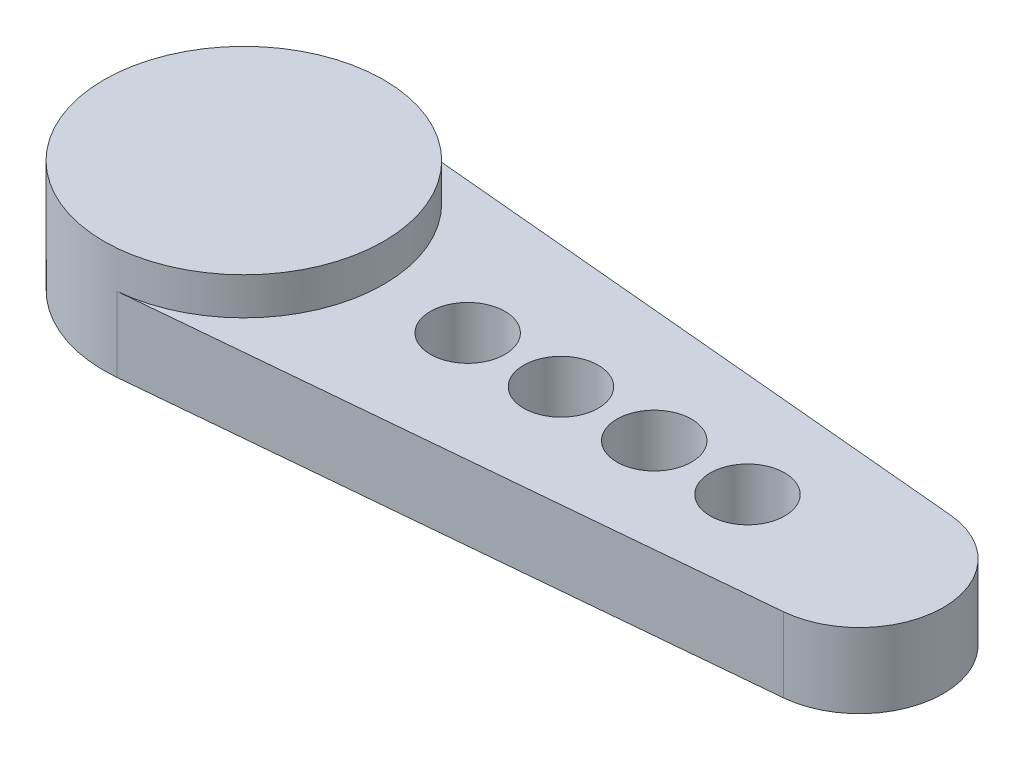
ISO-10303-21;
HEADER;
FILE_DESCRIPTION(('STEP AP214'),'2;1');
FILE_NAME('part.step','',(''),(''),'','','');
FILE_SCHEMA(('AUTOMOTIVE_DESIGN { 1 0 10303 214 1 1 1 1 }'));
ENDSEC;
DATA;
#1=APPLICATION_CONTEXT('core data for automotive mechanical design processes');
#2=APPLICATION_PROTOCOL_DEFINITION('international standard','automotive_design',2000,#1);
#3=PRODUCT_CONTEXT('',#1,'mechanical');
#4=PRODUCT('Part','Part','',(#3));
#5=PRODUCT_RELATED_PRODUCT_CATEGORY('part','',(#4));
#6=PRODUCT_DEFINITION_FORMATION('','',#4);
#7=PRODUCT_DEFINITION_CONTEXT('part definition',#1,'design');
#8=PRODUCT_DEFINITION('design','',#6,#7);
#9=PRODUCT_DEFINITION_SHAPE('','',#8);
#10=(LENGTH_UNIT() NAMED_UNIT(*) SI_UNIT(.MILLI.,.METRE.));
#11=(NAMED_UNIT(*) PLANE_ANGLE_UNIT() SI_UNIT($,.RADIAN.));
#12=(NAMED_UNIT(*) SI_UNIT($,.STERADIAN.) SOLID_ANGLE_UNIT());
#13=UNCERTAINTY_MEASURE_WITH_UNIT(LENGTH_MEASURE(1.E-05),#10,'distance_accuracy_value','');
#14=(GEOMETRIC_REPRESENTATION_CONTEXT(3) GLOBAL_UNCERTAINTY_ASSIGNED_CONTEXT((#13)) GLOBAL_UNIT_ASSIGNED_CONTEXT((#10,
#11,#12)) REPRESENTATION_CONTEXT('',''));
#15=CARTESIAN_POINT('',(0.,0.,0.));
#16=DIRECTION('',(0.,0.,1.));
#17=DIRECTION('',(1.,0.,0.));
#18=AXIS2_PLACEMENT_3D('',#15,#16,#17);
#19=CARTESIAN_POINT('',(0.,2.,0.));
#20=DIRECTION('',(0.,1.,0.));
#21=DIRECTION('',(0.,0.,1.));
#22=AXIS2_PLACEMENT_3D('',#19,#20,#21);
#23=PLANE('',#22);
#24=CARTESIAN_POINT('',(0.,2.,0.));
#25=DIRECTION('',(0.,1.,0.));
#26=DIRECTION('',(0.,0.,1.));
#27=AXIS2_PLACEMENT_3D('',#24,#25,#26);
#28=CIRCLE('',#27,3.75);
#29=CARTESIAN_POINT('',(0.340909090909091,2.,3.73447198298977));
#30=VERTEX_POINT('',#29);
#31=CARTESIAN_POINT('',(0.340909090909091,2.,-3.73447198298977));
#32=VERTEX_POINT('',#31);
#33=EDGE_CURVE('E88',#30,#32,#28,.T.);
#34=ORIENTED_EDGE('',*,*,#33,.F.);
#35=DIRECTION('',(0.995859195463938,0.,-0.0909090909090909));
#36=VECTOR('',#35,1.);
#37=CARTESIAN_POINT('',(0.340909090909091,2.,3.73447198298977));
#38=LINE('',#37,#36);
#39=CARTESIAN_POINT('',(16.7045454545455,2.,2.24068318979386));
#40=VERTEX_POINT('',#39);
#41=EDGE_CURVE('E80',#30,#40,#38,.T.);
#42=ORIENTED_EDGE('',*,*,#41,.T.);
#43=CARTESIAN_POINT('',(16.5,2.,0.));
#44=DIRECTION('',(0.,1.,0.));
#45=DIRECTION('',(0.,0.,1.));
#46=AXIS2_PLACEMENT_3D('',#43,#44,#45);
#47=CIRCLE('',#46,2.25);
#48=CARTESIAN_POINT('',(16.7045454545455,2.,-2.24068318979386));
#49=VERTEX_POINT('',#48);
#50=EDGE_CURVE('E94',#40,#49,#47,.T.);
#51=ORIENTED_EDGE('',*,*,#50,.T.);
#52=DIRECTION('',(-0.995859195463938,0.,-0.0909090909090909));
#53=VECTOR('',#52,1.);
#54=CARTESIAN_POINT('',(0.340909090909091,2.,-3.73447198298977));
#55=LINE('',#54,#53);
#56=EDGE_CURVE('E53',#49,#32,#55,.T.);
#57=ORIENTED_EDGE('',*,*,#56,.T.);
#58=EDGE_LOOP('',(#34,#42,#51,#57));
#59=FACE_BOUND('',#58,.T.);
#60=CARTESIAN_POINT('',(11.,2.,0.));
#61=DIRECTION('',(0.,1.,0.));
#62=DIRECTION('',(0.,0.,1.));
#63=AXIS2_PLACEMENT_3D('',#60,#61,#62);
#64=CIRCLE('',#63,1.);
#65=CARTESIAN_POINT('',(11.,2.,1.));
#66=VERTEX_POINT('',#65);
#67=EDGE_CURVE('E114',#66,#66,#64,.T.);
#68=ORIENTED_EDGE('',*,*,#67,.F.);
#69=EDGE_LOOP('',(#68));
#70=FACE_BOUND('',#69,.T.);
#71=CARTESIAN_POINT('',(6.,2.,0.));
#72=DIRECTION('',(0.,1.,0.));
#73=DIRECTION('',(0.,0.,1.));
#74=AXIS2_PLACEMENT_3D('',#71,#72,#73);
#75=CIRCLE('',#74,1.);
#76=CARTESIAN_POINT('',(6.,2.,1.));
#77=VERTEX_POINT('',#76);
#78=EDGE_CURVE('E126',#77,#77,#75,.T.);
#79=ORIENTED_EDGE('',*,*,#78,.F.);
#80=EDGE_LOOP('',(#79));
#81=FACE_BOUND('',#80,.T.);
#82=CARTESIAN_POINT('',(8.5,2.,0.));
#83=DIRECTION('',(0.,1.,0.));
#84=DIRECTION('',(0.,0.,1.));
#85=AXIS2_PLACEMENT_3D('',#82,#83,#84);
#86=CIRCLE('',#85,1.);
#87=CARTESIAN_POINT('',(8.5,2.,1.));
#88=VERTEX_POINT('',#87);
#89=EDGE_CURVE('E120',#88,#88,#86,.T.);
#90=ORIENTED_EDGE('',*,*,#89,.F.);
#91=EDGE_LOOP('',(#90));
#92=FACE_BOUND('',#91,.T.);
#93=CARTESIAN_POINT('',(13.5,2.,0.));
#94=DIRECTION('',(0.,1.,0.));
#95=DIRECTION('',(0.,0.,1.));
#96=AXIS2_PLACEMENT_3D('',#93,#94,#95);
#97=CIRCLE('',#96,1.);
#98=CARTESIAN_POINT('',(13.5,2.,1.));
#99=VERTEX_POINT('',#98);
#100=EDGE_CURVE('E108',#99,#99,#97,.T.);
#101=ORIENTED_EDGE('',*,*,#100,.F.);
#102=EDGE_LOOP('',(#101));
#103=FACE_BOUND('',#102,.T.);
#104=ADVANCED_FACE('F36',(#59,#70,#81,#92,#103),#23,.T.);
#105=CARTESIAN_POINT('',(0.,0.,0.));
#106=DIRECTION('',(0.,1.,0.));
#107=DIRECTION('',(0.,0.,1.));
#108=AXIS2_PLACEMENT_3D('',#105,#106,#107);
#109=PLANE('',#108);
#110=CARTESIAN_POINT('',(0.,0.,0.));
#111=DIRECTION('',(0.,-1.,0.));
#112=DIRECTION('',(0.,0.,-1.));
#113=AXIS2_PLACEMENT_3D('',#110,#111,#112);
#114=CIRCLE('',#113,2.75);
#115=CARTESIAN_POINT('',(0.,0.,-2.75));
#116=VERTEX_POINT('',#115);
#117=EDGE_CURVE('E104',#116,#116,#114,.T.);
#118=ORIENTED_EDGE('',*,*,#117,.F.);
#119=EDGE_LOOP('',(#118));
#120=FACE_BOUND('',#119,.T.);
#121=CARTESIAN_POINT('',(0.,0.,0.));
#122=DIRECTION('',(0.,1.,0.));
#123=DIRECTION('',(0.,0.,1.));
#124=AXIS2_PLACEMENT_3D('',#121,#122,#123);
#125=CIRCLE('',#124,3.75);
#126=CARTESIAN_POINT('',(0.340909090909091,0.,-3.73447198298977));
#127=VERTEX_POINT('',#126);
#128=CARTESIAN_POINT('',(0.340909090909091,0.,3.73447198298977));
#129=VERTEX_POINT('',#128);
#130=EDGE_CURVE('E90',#127,#129,#125,.T.);
#131=ORIENTED_EDGE('',*,*,#130,.F.);
#132=DIRECTION('',(-0.995859195463938,0.,-0.0909090909090909));
#133=VECTOR('',#132,1.);
#134=CARTESIAN_POINT('',(0.340909090909091,0.,-3.73447198298977));
#135=LINE('',#134,#133);
#136=CARTESIAN_POINT('',(16.7045454545455,0.,-2.24068318979386));
#137=VERTEX_POINT('',#136);
#138=EDGE_CURVE('E76',#137,#127,#135,.T.);
#139=ORIENTED_EDGE('',*,*,#138,.F.);
#140=CARTESIAN_POINT('',(16.5,0.,0.));
#141=DIRECTION('',(0.,1.,0.));
#142=DIRECTION('',(0.,0.,1.));
#143=AXIS2_PLACEMENT_3D('',#140,#141,#142);
#144=CIRCLE('',#143,2.25);
#145=CARTESIAN_POINT('',(16.7045454545455,0.,2.24068318979386));
#146=VERTEX_POINT('',#145);
#147=EDGE_CURVE('E71',#146,#137,#144,.T.);
#148=ORIENTED_EDGE('',*,*,#147,.F.);
#149=DIRECTION('',(0.995859195463938,0.,-0.0909090909090909));
#150=VECTOR('',#149,1.);
#151=CARTESIAN_POINT('',(0.340909090909091,0.,3.73447198298977));
#152=LINE('',#151,#150);
#153=EDGE_CURVE('E135',#129,#146,#152,.T.);
#154=ORIENTED_EDGE('',*,*,#153,.F.);
#155=EDGE_LOOP('',(#131,#139,#148,#154));
#156=FACE_BOUND('',#155,.T.);
#157=CARTESIAN_POINT('',(6.,0.,0.));
#158=DIRECTION('',(0.,1.,0.));
#159=DIRECTION('',(0.,0.,1.));
#160=AXIS2_PLACEMENT_3D('',#157,#158,#159);
#161=CIRCLE('',#160,1.);
#162=CARTESIAN_POINT('',(6.,0.,1.));
#163=VERTEX_POINT('',#162);
#164=EDGE_CURVE('E123',#163,#163,#161,.T.);
#165=ORIENTED_EDGE('',*,*,#164,.T.);
#166=EDGE_LOOP('',(#165));
#167=FACE_BOUND('',#166,.T.);
#168=CARTESIAN_POINT('',(8.5,0.,0.));
#169=DIRECTION('',(0.,1.,0.));
#170=DIRECTION('',(0.,0.,1.));
#171=AXIS2_PLACEMENT_3D('',#168,#169,#170);
#172=CIRCLE('',#171,1.);
#173=CARTESIAN_POINT('',(8.5,0.,1.));
#174=VERTEX_POINT('',#173);
#175=EDGE_CURVE('E117',#174,#174,#172,.T.);
#176=ORIENTED_EDGE('',*,*,#175,.T.);
#177=EDGE_LOOP('',(#176));
#178=FACE_BOUND('',#177,.T.);
#179=CARTESIAN_POINT('',(11.,0.,0.));
#180=DIRECTION('',(0.,1.,0.));
#181=DIRECTION('',(0.,0.,1.));
#182=AXIS2_PLACEMENT_3D('',#179,#180,#181);
#183=CIRCLE('',#182,1.);
#184=CARTESIAN_POINT('',(11.,0.,1.));
#185=VERTEX_POINT('',#184);
#186=EDGE_CURVE('E111',#185,#185,#183,.T.);
#187=ORIENTED_EDGE('',*,*,#186,.T.);
#188=EDGE_LOOP('',(#187));
#189=FACE_BOUND('',#188,.T.);
#190=CARTESIAN_POINT('',(13.5,0.,0.));
#191=DIRECTION('',(0.,1.,0.));
#192=DIRECTION('',(0.,0.,1.));
#193=AXIS2_PLACEMENT_3D('',#190,#191,#192);
#194=CIRCLE('',#193,1.);
#195=CARTESIAN_POINT('',(13.5,0.,1.));
#196=VERTEX_POINT('',#195);
#197=EDGE_CURVE('E101',#196,#196,#194,.T.);
#198=ORIENTED_EDGE('',*,*,#197,.T.);
#199=EDGE_LOOP('',(#198));
#200=FACE_BOUND('',#199,.T.);
#201=ADVANCED_FACE('F143',(#120,#156,#167,#178,#189,#200),#109,.F.);
#202=CARTESIAN_POINT('',(0.,2.,0.));
#203=DIRECTION('',(0.,-1.,0.));
#204=DIRECTION('',(0.,0.,-1.));
#205=AXIS2_PLACEMENT_3D('',#202,#203,#204);
#206=CYLINDRICAL_SURFACE('',#205,3.75);
#207=ORIENTED_EDGE('',*,*,#130,.T.);
#208=DIRECTION('',(0.,-1.,0.));
#209=VECTOR('',#208,1.);
#210=CARTESIAN_POINT('',(0.340909090909091,2.,3.73447198298977));
#211=LINE('',#210,#209);
#212=EDGE_CURVE('E11',#30,#129,#211,.T.);
#213=ORIENTED_EDGE('',*,*,#212,.F.);
#214=ORIENTED_EDGE('',*,*,#33,.T.);
#215=DIRECTION('',(0.,-1.,0.));
#216=VECTOR('',#215,1.);
#217=CARTESIAN_POINT('',(0.340909090909091,2.,-3.73447198298977));
#218=LINE('',#217,#216);
#219=EDGE_CURVE('E133',#32,#127,#218,.T.);
#220=ORIENTED_EDGE('',*,*,#219,.T.);
#221=EDGE_LOOP('',(#207,#213,#214,#220));
#222=FACE_BOUND('',#221,.T.);
#223=CARTESIAN_POINT('',(0.,3.,0.));
#224=DIRECTION('',(0.,1.,0.));
#225=DIRECTION('',(0.,0.,1.));
#226=AXIS2_PLACEMENT_3D('',#223,#224,#225);
#227=CIRCLE('',#226,3.75);
#228=CARTESIAN_POINT('',(0.,3.,3.75));
#229=VERTEX_POINT('',#228);
#230=EDGE_CURVE('E97',#229,#229,#227,.T.);
#231=ORIENTED_EDGE('',*,*,#230,.F.);
#232=EDGE_LOOP('',(#231));
#233=FACE_BOUND('',#232,.T.);
#234=ADVANCED_FACE('F38',(#222,#233),#206,.T.);
#235=CARTESIAN_POINT('',(0.340909090909091,2.,3.73447198298977));
#236=DIRECTION('',(-0.0909090909090909,0.,-0.995859195463938));
#237=DIRECTION('',(-0.995859195463938,0.,0.0909090909090909));
#238=AXIS2_PLACEMENT_3D('',#235,#236,#237);
#239=PLANE('',#238);
#240=ORIENTED_EDGE('',*,*,#153,.T.);
#241=DIRECTION('',(0.,-1.,0.));
#242=VECTOR('',#241,1.);
#243=CARTESIAN_POINT('',(16.7045454545455,2.,2.24068318979386));
#244=LINE('',#243,#242);
#245=EDGE_CURVE('E45',#40,#146,#244,.T.);
#246=ORIENTED_EDGE('',*,*,#245,.F.);
#247=ORIENTED_EDGE('',*,*,#41,.F.);
#248=ORIENTED_EDGE('',*,*,#212,.T.);
#249=EDGE_LOOP('',(#240,#246,#247,#248));
#250=FACE_BOUND('',#249,.T.);
#251=ADVANCED_FACE('F92',(#250),#239,.F.);
#252=CARTESIAN_POINT('',(16.5,2.,0.));
#253=DIRECTION('',(0.,-1.,0.));
#254=DIRECTION('',(0.,0.,-1.));
#255=AXIS2_PLACEMENT_3D('',#252,#253,#254);
#256=CYLINDRICAL_SURFACE('',#255,2.25);
#257=ORIENTED_EDGE('',*,*,#147,.T.);
#258=DIRECTION('',(0.,-1.,0.));
#259=VECTOR('',#258,1.);
#260=CARTESIAN_POINT('',(16.7045454545455,2.,-2.24068318979386));
#261=LINE('',#260,#259);
#262=EDGE_CURVE('E140',#49,#137,#261,.T.);
#263=ORIENTED_EDGE('',*,*,#262,.F.);
#264=ORIENTED_EDGE('',*,*,#50,.F.);
#265=ORIENTED_EDGE('',*,*,#245,.T.);
#266=EDGE_LOOP('',(#257,#263,#264,#265));
#267=FACE_BOUND('',#266,.T.);
#268=ADVANCED_FACE('F141',(#267),#256,.T.);
#269=CARTESIAN_POINT('',(0.340909090909091,2.,-3.73447198298977));
#270=DIRECTION('',(-0.0909090909090909,0.,0.995859195463938));
#271=DIRECTION('',(0.995859195463938,0.,0.0909090909090909));
#272=AXIS2_PLACEMENT_3D('',#269,#270,#271);
#273=PLANE('',#272);
#274=ORIENTED_EDGE('',*,*,#138,.T.);
#275=ORIENTED_EDGE('',*,*,#219,.F.);
#276=ORIENTED_EDGE('',*,*,#56,.F.);
#277=ORIENTED_EDGE('',*,*,#262,.T.);
#278=EDGE_LOOP('',(#274,#275,#276,#277));
#279=FACE_BOUND('',#278,.T.);
#280=ADVANCED_FACE('F180',(#279),#273,.F.);
#281=CARTESIAN_POINT('',(6.,2.,0.));
#282=DIRECTION('',(0.,-1.,0.));
#283=DIRECTION('',(0.,0.,-1.));
#284=AXIS2_PLACEMENT_3D('',#281,#282,#283);
#285=CYLINDRICAL_SURFACE('',#284,1.);
#286=ORIENTED_EDGE('',*,*,#78,.T.);
#287=EDGE_LOOP('',(#286));
#288=FACE_BOUND('',#287,.T.);
#289=ORIENTED_EDGE('',*,*,#164,.F.);
#290=EDGE_LOOP('',(#289));
#291=FACE_BOUND('',#290,.T.);
#292=ADVANCED_FACE('F177',(#288,#291),#285,.F.);
#293=CARTESIAN_POINT('',(8.5,2.,0.));
#294=DIRECTION('',(0.,-1.,0.));
#295=DIRECTION('',(0.,0.,-1.));
#296=AXIS2_PLACEMENT_3D('',#293,#294,#295);
#297=CYLINDRICAL_SURFACE('',#296,1.);
#298=ORIENTED_EDGE('',*,*,#89,.T.);
#299=EDGE_LOOP('',(#298));
#300=FACE_BOUND('',#299,.T.);
#301=ORIENTED_EDGE('',*,*,#175,.F.);
#302=EDGE_LOOP('',(#301));
#303=FACE_BOUND('',#302,.T.);
#304=ADVANCED_FACE('F169',(#300,#303),#297,.F.);
#305=CARTESIAN_POINT('',(11.,2.,0.));
#306=DIRECTION('',(0.,-1.,0.));
#307=DIRECTION('',(0.,0.,-1.));
#308=AXIS2_PLACEMENT_3D('',#305,#306,#307);
#309=CYLINDRICAL_SURFACE('',#308,1.);
#310=ORIENTED_EDGE('',*,*,#67,.T.);
#311=EDGE_LOOP('',(#310));
#312=FACE_BOUND('',#311,.T.);
#313=ORIENTED_EDGE('',*,*,#186,.F.);
#314=EDGE_LOOP('',(#313));
#315=FACE_BOUND('',#314,.T.);
#316=ADVANCED_FACE('F159',(#312,#315),#309,.F.);
#317=CARTESIAN_POINT('',(13.5,2.,0.));
#318=DIRECTION('',(0.,-1.,0.));
#319=DIRECTION('',(0.,0.,-1.));
#320=AXIS2_PLACEMENT_3D('',#317,#318,#319);
#321=CYLINDRICAL_SURFACE('',#320,1.);
#322=ORIENTED_EDGE('',*,*,#100,.T.);
#323=EDGE_LOOP('',(#322));
#324=FACE_BOUND('',#323,.T.);
#325=ORIENTED_EDGE('',*,*,#197,.F.);
#326=EDGE_LOOP('',(#325));
#327=FACE_BOUND('',#326,.T.);
#328=ADVANCED_FACE('F156',(#324,#327),#321,.F.);
#329=CARTESIAN_POINT('',(0.,3.,0.));
#330=DIRECTION('',(0.,1.,0.));
#331=DIRECTION('',(0.,0.,1.));
#332=AXIS2_PLACEMENT_3D('',#329,#330,#331);
#333=PLANE('',#332);
#334=ORIENTED_EDGE('',*,*,#230,.T.);
#335=EDGE_LOOP('',(#334));
#336=FACE_BOUND('',#335,.T.);
#337=ADVANCED_FACE('F158',(#336),#333,.T.);
#338=CARTESIAN_POINT('',(0.,1.,0.));
#339=DIRECTION('',(0.,-1.,0.));
#340=DIRECTION('',(0.,0.,-1.));
#341=AXIS2_PLACEMENT_3D('',#338,#339,#340);
#342=CYLINDRICAL_SURFACE('',#341,2.75);
#343=CARTESIAN_POINT('',(0.,1.,0.));
#344=DIRECTION('',(0.,-1.,0.));
#345=DIRECTION('',(0.,0.,-1.));
#346=AXIS2_PLACEMENT_3D('',#343,#344,#345);
#347=CIRCLE('',#346,2.75);
#348=CARTESIAN_POINT('',(0.,1.,-2.75));
#349=VERTEX_POINT('',#348);
#350=EDGE_CURVE('E98',#349,#349,#347,.T.);
#351=ORIENTED_EDGE('',*,*,#350,.F.);
#352=EDGE_LOOP('',(#351));
#353=FACE_BOUND('',#352,.T.);
#354=ORIENTED_EDGE('',*,*,#117,.T.);
#355=EDGE_LOOP('',(#354));
#356=FACE_BOUND('',#355,.T.);
#357=ADVANCED_FACE('F166',(#353,#356),#342,.F.);
#358=CARTESIAN_POINT('',(0.,1.,0.));
#359=DIRECTION('',(0.,-1.,0.));
#360=DIRECTION('',(0.,0.,-1.));
#361=AXIS2_PLACEMENT_3D('',#358,#359,#360);
#362=PLANE('',#361);
#363=ORIENTED_EDGE('',*,*,#350,.T.);
#364=EDGE_LOOP('',(#363));
#365=FACE_BOUND('',#364,.T.);
#366=ADVANCED_FACE('F210',(#365),#362,.T.);
#367=CLOSED_SHELL('',(#104,#201,#234,#251,#268,#280,#292,#304,#316,#328,#337,#357,#366));
#368=MANIFOLD_SOLID_BREP('B2',#367);
#369=ADVANCED_BREP_SHAPE_REPRESENTATION('',(#18,#368),#14);
#370=SHAPE_DEFINITION_REPRESENTATION(#9,#369);
ENDSEC;
END-ISO-10303-21;
